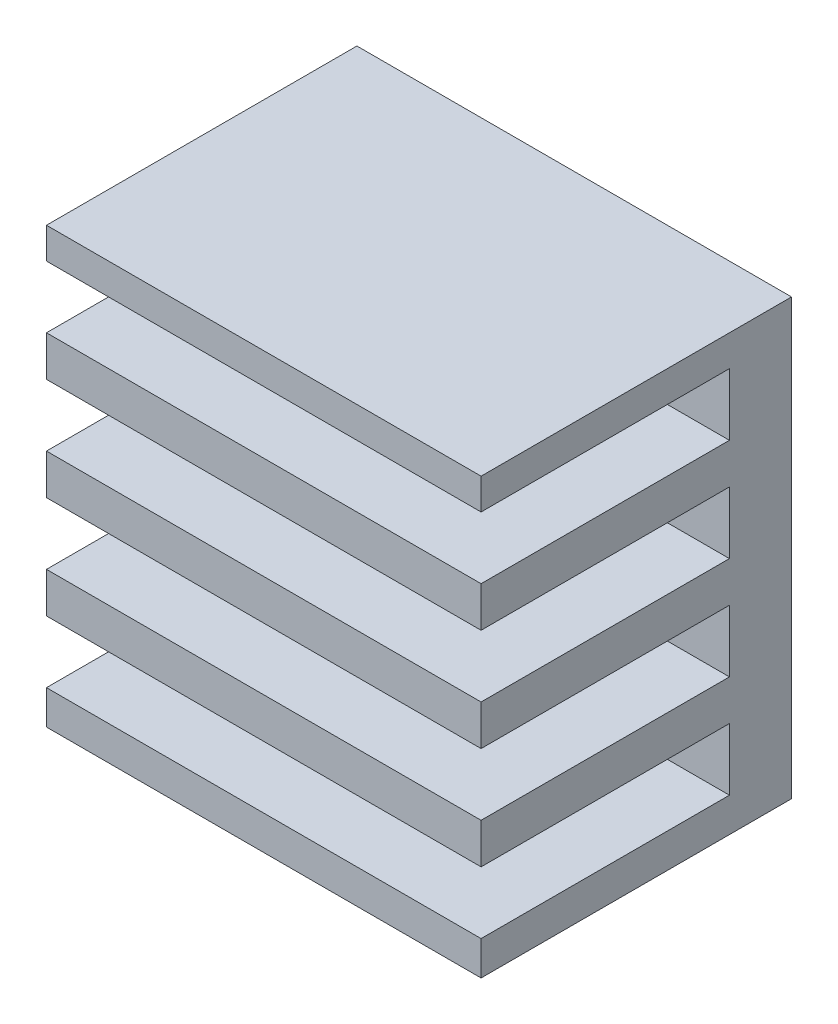
ISO-10303-21;
HEADER;
FILE_DESCRIPTION(('STEP AP214'),'2;1');
FILE_NAME('part.step','',(''),(''),'','','');
FILE_SCHEMA(('AUTOMOTIVE_DESIGN { 1 0 10303 214 1 1 1 1 }'));
ENDSEC;
DATA;
#1=APPLICATION_CONTEXT('core data for automotive mechanical design processes');
#2=APPLICATION_PROTOCOL_DEFINITION('international standard','automotive_design',2000,#1);
#3=PRODUCT_CONTEXT('',#1,'mechanical');
#4=PRODUCT('Part','Part','',(#3));
#5=PRODUCT_RELATED_PRODUCT_CATEGORY('part','',(#4));
#6=PRODUCT_DEFINITION_FORMATION('','',#4);
#7=PRODUCT_DEFINITION_CONTEXT('part definition',#1,'design');
#8=PRODUCT_DEFINITION('design','',#6,#7);
#9=PRODUCT_DEFINITION_SHAPE('','',#8);
#10=(LENGTH_UNIT() NAMED_UNIT(*) SI_UNIT(.MILLI.,.METRE.));
#11=(NAMED_UNIT(*) PLANE_ANGLE_UNIT() SI_UNIT($,.RADIAN.));
#12=(NAMED_UNIT(*) SI_UNIT($,.STERADIAN.) SOLID_ANGLE_UNIT());
#13=UNCERTAINTY_MEASURE_WITH_UNIT(LENGTH_MEASURE(1.E-05),#10,'distance_accuracy_value','');
#14=(GEOMETRIC_REPRESENTATION_CONTEXT(3) GLOBAL_UNCERTAINTY_ASSIGNED_CONTEXT((#13)) GLOBAL_UNIT_ASSIGNED_CONTEXT((#10,
#11,#12)) REPRESENTATION_CONTEXT('',''));
#15=CARTESIAN_POINT('',(0.,0.,0.));
#16=DIRECTION('',(0.,0.,1.));
#17=DIRECTION('',(1.,0.,0.));
#18=AXIS2_PLACEMENT_3D('',#15,#16,#17);
#19=CARTESIAN_POINT('',(0.,0.,10.));
#20=DIRECTION('',(0.,0.,1.));
#21=DIRECTION('',(1.,0.,0.));
#22=AXIS2_PLACEMENT_3D('',#19,#20,#21);
#23=PLANE('',#22);
#24=DIRECTION('',(-1.,0.,0.));
#25=VECTOR('',#24,1.);
#26=CARTESIAN_POINT('',(30.5,28.1999999999999,10.));
#27=LINE('',#26,#25);
#28=CARTESIAN_POINT('',(30.5,28.1999999999999,10.));
#29=VERTEX_POINT('',#28);
#30=CARTESIAN_POINT('',(16.5,28.1999999999999,10.));
#31=VERTEX_POINT('',#30);
#32=EDGE_CURVE('E281',#29,#31,#27,.T.);
#33=ORIENTED_EDGE('',*,*,#32,.T.);
#34=DIRECTION('',(0.,-1.,0.));
#35=VECTOR('',#34,1.);
#36=CARTESIAN_POINT('',(16.5,34.4999999999999,10.));
#37=LINE('',#36,#35);
#38=CARTESIAN_POINT('',(16.5,26.8999999999999,10.));
#39=VERTEX_POINT('',#38);
#40=EDGE_CURVE('E317',#31,#39,#37,.T.);
#41=ORIENTED_EDGE('',*,*,#40,.T.);
#42=DIRECTION('',(-1.,0.,0.));
#43=VECTOR('',#42,1.);
#44=CARTESIAN_POINT('',(30.5,26.8999999999999,10.));
#45=LINE('',#44,#43);
#46=CARTESIAN_POINT('',(30.5,26.8999999999999,10.));
#47=VERTEX_POINT('',#46);
#48=EDGE_CURVE('E227',#47,#39,#45,.T.);
#49=ORIENTED_EDGE('',*,*,#48,.F.);
#50=DIRECTION('',(0.,1.,0.));
#51=VECTOR('',#50,1.);
#52=CARTESIAN_POINT('',(30.5,34.4999999999999,10.));
#53=LINE('',#52,#51);
#54=EDGE_CURVE('E194',#47,#29,#53,.T.);
#55=ORIENTED_EDGE('',*,*,#54,.T.);
#56=EDGE_LOOP('',(#33,#41,#49,#55));
#57=FACE_BOUND('',#56,.T.);
#58=ADVANCED_FACE('F32',(#57),#23,.T.);
#59=DIRECTION('',(-1.,0.,0.));
#60=VECTOR('',#59,1.);
#61=CARTESIAN_POINT('',(30.5,24.8999999999999,10.));
#62=LINE('',#61,#60);
#63=CARTESIAN_POINT('',(30.5,24.8999999999999,10.));
#64=VERTEX_POINT('',#63);
#65=CARTESIAN_POINT('',(16.5,24.8999999999999,10.));
#66=VERTEX_POINT('',#65);
#67=EDGE_CURVE('E216',#64,#66,#62,.T.);
#68=ORIENTED_EDGE('',*,*,#67,.T.);
#69=CARTESIAN_POINT('',(16.5,23.5999999999999,10.));
#70=VERTEX_POINT('',#69);
#71=EDGE_CURVE('E315',#66,#70,#37,.T.);
#72=ORIENTED_EDGE('',*,*,#71,.T.);
#73=DIRECTION('',(-1.,0.,0.));
#74=VECTOR('',#73,1.);
#75=CARTESIAN_POINT('',(30.5,23.5999999999999,10.));
#76=LINE('',#75,#74);
#77=CARTESIAN_POINT('',(30.5,23.5999999999999,10.));
#78=VERTEX_POINT('',#77);
#79=EDGE_CURVE('E218',#78,#70,#76,.T.);
#80=ORIENTED_EDGE('',*,*,#79,.F.);
#81=EDGE_CURVE('E199',#78,#64,#53,.T.);
#82=ORIENTED_EDGE('',*,*,#81,.T.);
#83=EDGE_LOOP('',(#68,#72,#80,#82));
#84=FACE_BOUND('',#83,.T.);
#85=ADVANCED_FACE('F214',(#84),#23,.T.);
#86=DIRECTION('',(-1.,0.,0.));
#87=VECTOR('',#86,1.);
#88=CARTESIAN_POINT('',(30.5,21.5999999999999,10.));
#89=LINE('',#88,#87);
#90=CARTESIAN_POINT('',(30.5,21.5999999999999,10.));
#91=VERTEX_POINT('',#90);
#92=CARTESIAN_POINT('',(16.5,21.5999999999999,10.));
#93=VERTEX_POINT('',#92);
#94=EDGE_CURVE('E239',#91,#93,#89,.T.);
#95=ORIENTED_EDGE('',*,*,#94,.T.);
#96=CARTESIAN_POINT('',(16.5,20.4999999999999,10.));
#97=VERTEX_POINT('',#96);
#98=EDGE_CURVE('E295',#93,#97,#37,.T.);
#99=ORIENTED_EDGE('',*,*,#98,.T.);
#100=DIRECTION('',(1.,0.,0.));
#101=VECTOR('',#100,1.);
#102=CARTESIAN_POINT('',(16.5,20.4999999999999,10.));
#103=LINE('',#102,#101);
#104=CARTESIAN_POINT('',(30.5,20.4999999999999,10.));
#105=VERTEX_POINT('',#104);
#106=EDGE_CURVE('E200',#97,#105,#103,.T.);
#107=ORIENTED_EDGE('',*,*,#106,.T.);
#108=EDGE_CURVE('E197',#105,#91,#53,.T.);
#109=ORIENTED_EDGE('',*,*,#108,.T.);
#110=EDGE_LOOP('',(#95,#99,#107,#109));
#111=FACE_BOUND('',#110,.T.);
#112=ADVANCED_FACE('F298',(#111),#23,.T.);
#113=DIRECTION('',(-1.,0.,0.));
#114=VECTOR('',#113,1.);
#115=CARTESIAN_POINT('',(30.5,30.1999999999999,10.));
#116=LINE('',#115,#114);
#117=CARTESIAN_POINT('',(30.5,30.1999999999999,10.));
#118=VERTEX_POINT('',#117);
#119=CARTESIAN_POINT('',(16.5,30.1999999999999,10.));
#120=VERTEX_POINT('',#119);
#121=EDGE_CURVE('E172',#118,#120,#116,.T.);
#122=ORIENTED_EDGE('',*,*,#121,.F.);
#123=CARTESIAN_POINT('',(30.5,31.4999999999999,10.));
#124=VERTEX_POINT('',#123);
#125=EDGE_CURVE('E183',#118,#124,#53,.T.);
#126=ORIENTED_EDGE('',*,*,#125,.T.);
#127=DIRECTION('',(-1.,0.,0.));
#128=VECTOR('',#127,1.);
#129=CARTESIAN_POINT('',(30.5,31.4999999999999,10.));
#130=LINE('',#129,#128);
#131=CARTESIAN_POINT('',(16.5,31.4999999999999,10.));
#132=VERTEX_POINT('',#131);
#133=EDGE_CURVE('E285',#124,#132,#130,.T.);
#134=ORIENTED_EDGE('',*,*,#133,.T.);
#135=EDGE_CURVE('E186',#132,#120,#37,.T.);
#136=ORIENTED_EDGE('',*,*,#135,.T.);
#137=EDGE_LOOP('',(#122,#126,#134,#136));
#138=FACE_BOUND('',#137,.T.);
#139=ADVANCED_FACE('F181',(#138),#23,.T.);
#140=CARTESIAN_POINT('',(16.5,34.4999999999999,10.));
#141=DIRECTION('',(1.,0.,0.));
#142=DIRECTION('',(0.,0.,-1.));
#143=AXIS2_PLACEMENT_3D('',#140,#141,#142);
#144=PLANE('',#143);
#145=ORIENTED_EDGE('',*,*,#40,.F.);
#146=DIRECTION('',(0.,0.,1.));
#147=VECTOR('',#146,1.);
#148=CARTESIAN_POINT('',(16.5,28.1999999999999,10.));
#149=LINE('',#148,#147);
#150=CARTESIAN_POINT('',(16.5,28.1999999999999,2.));
#151=VERTEX_POINT('',#150);
#152=EDGE_CURVE('E177',#151,#31,#149,.T.);
#153=ORIENTED_EDGE('',*,*,#152,.F.);
#154=DIRECTION('',(0.,-1.,0.));
#155=VECTOR('',#154,1.);
#156=CARTESIAN_POINT('',(16.5,30.1999999999999,2.));
#157=LINE('',#156,#155);
#158=CARTESIAN_POINT('',(16.5,30.1999999999999,2.));
#159=VERTEX_POINT('',#158);
#160=EDGE_CURVE('E369',#159,#151,#157,.T.);
#161=ORIENTED_EDGE('',*,*,#160,.F.);
#162=DIRECTION('',(0.,0.,-1.));
#163=VECTOR('',#162,1.);
#164=CARTESIAN_POINT('',(16.5,30.1999999999999,10.));
#165=LINE('',#164,#163);
#166=EDGE_CURVE('E245',#120,#159,#165,.T.);
#167=ORIENTED_EDGE('',*,*,#166,.F.);
#168=ORIENTED_EDGE('',*,*,#135,.F.);
#169=DIRECTION('',(0.,0.,1.));
#170=VECTOR('',#169,1.);
#171=CARTESIAN_POINT('',(16.5,31.4999999999999,10.));
#172=LINE('',#171,#170);
#173=CARTESIAN_POINT('',(16.5,31.4999999999999,2.));
#174=VERTEX_POINT('',#173);
#175=EDGE_CURVE('E273',#174,#132,#172,.T.);
#176=ORIENTED_EDGE('',*,*,#175,.F.);
#177=DIRECTION('',(0.,-1.,0.));
#178=VECTOR('',#177,1.);
#179=CARTESIAN_POINT('',(16.5,33.4999999999999,2.));
#180=LINE('',#179,#178);
#181=CARTESIAN_POINT('',(16.5,33.4999999999999,2.));
#182=VERTEX_POINT('',#181);
#183=EDGE_CURVE('E280',#182,#174,#180,.T.);
#184=ORIENTED_EDGE('',*,*,#183,.F.);
#185=DIRECTION('',(0.,0.,-1.));
#186=VECTOR('',#185,1.);
#187=CARTESIAN_POINT('',(16.5,33.4999999999999,10.));
#188=LINE('',#187,#186);
#189=CARTESIAN_POINT('',(16.5,33.4999999999999,10.));
#190=VERTEX_POINT('',#189);
#191=EDGE_CURVE('E277',#190,#182,#188,.T.);
#192=ORIENTED_EDGE('',*,*,#191,.F.);
#193=CARTESIAN_POINT('',(16.5,34.4999999999999,10.));
#194=VERTEX_POINT('',#193);
#195=EDGE_CURVE('E293',#194,#190,#37,.T.);
#196=ORIENTED_EDGE('',*,*,#195,.F.);
#197=DIRECTION('',(0.,0.,-1.));
#198=VECTOR('',#197,1.);
#199=CARTESIAN_POINT('',(16.5,34.4999999999999,10.));
#200=LINE('',#199,#198);
#201=CARTESIAN_POINT('',(16.5,34.4999999999999,0.));
#202=VERTEX_POINT('',#201);
#203=EDGE_CURVE('E208',#194,#202,#200,.T.);
#204=ORIENTED_EDGE('',*,*,#203,.T.);
#205=DIRECTION('',(0.,-1.,0.));
#206=VECTOR('',#205,1.);
#207=CARTESIAN_POINT('',(16.5,34.4999999999999,0.));
#208=LINE('',#207,#206);
#209=CARTESIAN_POINT('',(16.5,20.4999999999999,0.));
#210=VERTEX_POINT('',#209);
#211=EDGE_CURVE('E287',#202,#210,#208,.T.);
#212=ORIENTED_EDGE('',*,*,#211,.T.);
#213=DIRECTION('',(0.,0.,-1.));
#214=VECTOR('',#213,1.);
#215=CARTESIAN_POINT('',(16.5,20.4999999999999,10.));
#216=LINE('',#215,#214);
#217=EDGE_CURVE('E11',#97,#210,#216,.T.);
#218=ORIENTED_EDGE('',*,*,#217,.F.);
#219=ORIENTED_EDGE('',*,*,#98,.F.);
#220=DIRECTION('',(0.,0.,1.));
#221=VECTOR('',#220,1.);
#222=CARTESIAN_POINT('',(16.5,21.5999999999999,10.));
#223=LINE('',#222,#221);
#224=CARTESIAN_POINT('',(16.5,21.5999999999999,2.));
#225=VERTEX_POINT('',#224);
#226=EDGE_CURVE('E251',#225,#93,#223,.T.);
#227=ORIENTED_EDGE('',*,*,#226,.F.);
#228=DIRECTION('',(0.,-1.,0.));
#229=VECTOR('',#228,1.);
#230=CARTESIAN_POINT('',(16.5,23.5999999999999,2.));
#231=LINE('',#230,#229);
#232=CARTESIAN_POINT('',(16.5,23.5999999999999,2.));
#233=VERTEX_POINT('',#232);
#234=EDGE_CURVE('E259',#233,#225,#231,.T.);
#235=ORIENTED_EDGE('',*,*,#234,.F.);
#236=DIRECTION('',(0.,0.,-1.));
#237=VECTOR('',#236,1.);
#238=CARTESIAN_POINT('',(16.5,23.5999999999999,10.));
#239=LINE('',#238,#237);
#240=EDGE_CURVE('E256',#70,#233,#239,.T.);
#241=ORIENTED_EDGE('',*,*,#240,.F.);
#242=ORIENTED_EDGE('',*,*,#71,.F.);
#243=DIRECTION('',(0.,0.,1.));
#244=VECTOR('',#243,1.);
#245=CARTESIAN_POINT('',(16.5,24.8999999999999,10.));
#246=LINE('',#245,#244);
#247=CARTESIAN_POINT('',(16.5,24.8999999999999,2.));
#248=VERTEX_POINT('',#247);
#249=EDGE_CURVE('E242',#248,#66,#246,.T.);
#250=ORIENTED_EDGE('',*,*,#249,.F.);
#251=DIRECTION('',(0.,-1.,0.));
#252=VECTOR('',#251,1.);
#253=CARTESIAN_POINT('',(16.5,26.8999999999999,2.));
#254=LINE('',#253,#252);
#255=CARTESIAN_POINT('',(16.5,26.8999999999999,2.));
#256=VERTEX_POINT('',#255);
#257=EDGE_CURVE('E238',#256,#248,#254,.T.);
#258=ORIENTED_EDGE('',*,*,#257,.F.);
#259=DIRECTION('',(0.,0.,-1.));
#260=VECTOR('',#259,1.);
#261=CARTESIAN_POINT('',(16.5,26.8999999999999,10.));
#262=LINE('',#261,#260);
#263=EDGE_CURVE('E235',#39,#256,#262,.T.);
#264=ORIENTED_EDGE('',*,*,#263,.F.);
#265=EDGE_LOOP('',(#145,#153,#161,#167,#168,#176,#184,#192,#196,#204,#212,#218,#219,#227,#235,
#241,#242,#250,#258,#264));
#266=FACE_BOUND('',#265,.T.);
#267=ADVANCED_FACE('F34',(#266),#144,.F.);
#268=CARTESIAN_POINT('',(16.5,20.4999999999999,10.));
#269=DIRECTION('',(0.,1.,0.));
#270=DIRECTION('',(-1.,0.,0.));
#271=AXIS2_PLACEMENT_3D('',#268,#269,#270);
#272=PLANE('',#271);
#273=DIRECTION('',(1.,0.,0.));
#274=VECTOR('',#273,1.);
#275=CARTESIAN_POINT('',(16.5,20.4999999999999,0.));
#276=LINE('',#275,#274);
#277=CARTESIAN_POINT('',(30.5,20.4999999999999,0.));
#278=VERTEX_POINT('',#277);
#279=EDGE_CURVE('E304',#210,#278,#276,.T.);
#280=ORIENTED_EDGE('',*,*,#279,.T.);
#281=DIRECTION('',(0.,0.,-1.));
#282=VECTOR('',#281,1.);
#283=CARTESIAN_POINT('',(30.5,20.4999999999999,10.));
#284=LINE('',#283,#282);
#285=EDGE_CURVE('E40',#105,#278,#284,.T.);
#286=ORIENTED_EDGE('',*,*,#285,.F.);
#287=ORIENTED_EDGE('',*,*,#106,.F.);
#288=ORIENTED_EDGE('',*,*,#217,.T.);
#289=EDGE_LOOP('',(#280,#286,#287,#288));
#290=FACE_BOUND('',#289,.T.);
#291=ADVANCED_FACE('F303',(#290),#272,.F.);
#292=CARTESIAN_POINT('',(30.5,34.4999999999999,10.));
#293=DIRECTION('',(-1.,0.,0.));
#294=DIRECTION('',(0.,-1.,0.));
#295=AXIS2_PLACEMENT_3D('',#292,#293,#294);
#296=PLANE('',#295);
#297=DIRECTION('',(0.,-1.,0.));
#298=VECTOR('',#297,1.);
#299=CARTESIAN_POINT('',(30.5,30.1999999999999,2.));
#300=LINE('',#299,#298);
#301=CARTESIAN_POINT('',(30.5,30.1999999999999,2.));
#302=VERTEX_POINT('',#301);
#303=CARTESIAN_POINT('',(30.5,28.1999999999999,2.));
#304=VERTEX_POINT('',#303);
#305=EDGE_CURVE('E47',#302,#304,#300,.T.);
#306=ORIENTED_EDGE('',*,*,#305,.T.);
#307=DIRECTION('',(0.,0.,1.));
#308=VECTOR('',#307,1.);
#309=CARTESIAN_POINT('',(30.5,28.1999999999999,10.));
#310=LINE('',#309,#308);
#311=EDGE_CURVE('E187',#304,#29,#310,.T.);
#312=ORIENTED_EDGE('',*,*,#311,.T.);
#313=ORIENTED_EDGE('',*,*,#54,.F.);
#314=DIRECTION('',(0.,0.,-1.));
#315=VECTOR('',#314,1.);
#316=CARTESIAN_POINT('',(30.5,26.8999999999999,10.));
#317=LINE('',#316,#315);
#318=CARTESIAN_POINT('',(30.5,26.8999999999999,2.));
#319=VERTEX_POINT('',#318);
#320=EDGE_CURVE('E231',#47,#319,#317,.T.);
#321=ORIENTED_EDGE('',*,*,#320,.T.);
#322=DIRECTION('',(0.,-1.,0.));
#323=VECTOR('',#322,1.);
#324=CARTESIAN_POINT('',(30.5,26.8999999999999,2.));
#325=LINE('',#324,#323);
#326=CARTESIAN_POINT('',(30.5,24.8999999999999,2.));
#327=VERTEX_POINT('',#326);
#328=EDGE_CURVE('E55',#319,#327,#325,.T.);
#329=ORIENTED_EDGE('',*,*,#328,.T.);
#330=DIRECTION('',(0.,0.,1.));
#331=VECTOR('',#330,1.);
#332=CARTESIAN_POINT('',(30.5,24.8999999999999,10.));
#333=LINE('',#332,#331);
#334=EDGE_CURVE('E224',#327,#64,#333,.T.);
#335=ORIENTED_EDGE('',*,*,#334,.T.);
#336=ORIENTED_EDGE('',*,*,#81,.F.);
#337=DIRECTION('',(0.,0.,-1.));
#338=VECTOR('',#337,1.);
#339=CARTESIAN_POINT('',(30.5,23.5999999999999,10.));
#340=LINE('',#339,#338);
#341=CARTESIAN_POINT('',(30.5,23.5999999999999,2.));
#342=VERTEX_POINT('',#341);
#343=EDGE_CURVE('E222',#78,#342,#340,.T.);
#344=ORIENTED_EDGE('',*,*,#343,.T.);
#345=DIRECTION('',(0.,-1.,0.));
#346=VECTOR('',#345,1.);
#347=CARTESIAN_POINT('',(30.5,23.5999999999999,2.));
#348=LINE('',#347,#346);
#349=CARTESIAN_POINT('',(30.5,21.5999999999999,2.));
#350=VERTEX_POINT('',#349);
#351=EDGE_CURVE('E250',#342,#350,#348,.T.);
#352=ORIENTED_EDGE('',*,*,#351,.T.);
#353=DIRECTION('',(0.,0.,1.));
#354=VECTOR('',#353,1.);
#355=CARTESIAN_POINT('',(30.5,21.5999999999999,10.));
#356=LINE('',#355,#354);
#357=EDGE_CURVE('E253',#350,#91,#356,.T.);
#358=ORIENTED_EDGE('',*,*,#357,.T.);
#359=ORIENTED_EDGE('',*,*,#108,.F.);
#360=ORIENTED_EDGE('',*,*,#285,.T.);
#361=DIRECTION('',(0.,1.,0.));
#362=VECTOR('',#361,1.);
#363=CARTESIAN_POINT('',(30.5,34.4999999999999,0.));
#364=LINE('',#363,#362);
#365=CARTESIAN_POINT('',(30.5,34.4999999999999,0.));
#366=VERTEX_POINT('',#365);
#367=EDGE_CURVE('E318',#278,#366,#364,.T.);
#368=ORIENTED_EDGE('',*,*,#367,.T.);
#369=DIRECTION('',(0.,0.,-1.));
#370=VECTOR('',#369,1.);
#371=CARTESIAN_POINT('',(30.5,34.4999999999999,10.));
#372=LINE('',#371,#370);
#373=CARTESIAN_POINT('',(30.5,34.4999999999999,10.));
#374=VERTEX_POINT('',#373);
#375=EDGE_CURVE('E306',#374,#366,#372,.T.);
#376=ORIENTED_EDGE('',*,*,#375,.F.);
#377=CARTESIAN_POINT('',(30.5,33.4999999999999,10.));
#378=VERTEX_POINT('',#377);
#379=EDGE_CURVE('E195',#378,#374,#53,.T.);
#380=ORIENTED_EDGE('',*,*,#379,.F.);
#381=DIRECTION('',(0.,0.,-1.));
#382=VECTOR('',#381,1.);
#383=CARTESIAN_POINT('',(30.5,33.4999999999999,10.));
#384=LINE('',#383,#382);
#385=CARTESIAN_POINT('',(30.5,33.4999999999999,2.));
#386=VERTEX_POINT('',#385);
#387=EDGE_CURVE('E269',#378,#386,#384,.T.);
#388=ORIENTED_EDGE('',*,*,#387,.T.);
#389=DIRECTION('',(0.,-1.,0.));
#390=VECTOR('',#389,1.);
#391=CARTESIAN_POINT('',(30.5,33.4999999999999,2.));
#392=LINE('',#391,#390);
#393=CARTESIAN_POINT('',(30.5,31.4999999999999,2.));
#394=VERTEX_POINT('',#393);
#395=EDGE_CURVE('E272',#386,#394,#392,.T.);
#396=ORIENTED_EDGE('',*,*,#395,.T.);
#397=DIRECTION('',(0.,0.,1.));
#398=VECTOR('',#397,1.);
#399=CARTESIAN_POINT('',(30.5,31.4999999999999,10.));
#400=LINE('',#399,#398);
#401=EDGE_CURVE('E193',#394,#124,#400,.T.);
#402=ORIENTED_EDGE('',*,*,#401,.T.);
#403=ORIENTED_EDGE('',*,*,#125,.F.);
#404=DIRECTION('',(0.,0.,-1.));
#405=VECTOR('',#404,1.);
#406=CARTESIAN_POINT('',(30.5,30.1999999999999,10.));
#407=LINE('',#406,#405);
#408=EDGE_CURVE('E168',#118,#302,#407,.T.);
#409=ORIENTED_EDGE('',*,*,#408,.T.);
#410=EDGE_LOOP('',(#306,#312,#313,#321,#329,#335,#336,#344,#352,#358,#359,#360,#368,#376,#380,
#388,#396,#402,#403,#409));
#411=FACE_BOUND('',#410,.T.);
#412=ADVANCED_FACE('F190',(#411),#296,.F.);
#413=CARTESIAN_POINT('',(16.5,34.4999999999999,10.));
#414=DIRECTION('',(0.,-1.,0.));
#415=DIRECTION('',(0.,0.,-1.));
#416=AXIS2_PLACEMENT_3D('',#413,#414,#415);
#417=PLANE('',#416);
#418=DIRECTION('',(-1.,0.,0.));
#419=VECTOR('',#418,1.);
#420=CARTESIAN_POINT('',(16.5,34.4999999999999,0.));
#421=LINE('',#420,#419);
#422=EDGE_CURVE('E316',#366,#202,#421,.T.);
#423=ORIENTED_EDGE('',*,*,#422,.T.);
#424=ORIENTED_EDGE('',*,*,#203,.F.);
#425=DIRECTION('',(-1.,0.,0.));
#426=VECTOR('',#425,1.);
#427=CARTESIAN_POINT('',(16.5,34.4999999999999,10.));
#428=LINE('',#427,#426);
#429=EDGE_CURVE('E204',#374,#194,#428,.T.);
#430=ORIENTED_EDGE('',*,*,#429,.F.);
#431=ORIENTED_EDGE('',*,*,#375,.T.);
#432=EDGE_LOOP('',(#423,#424,#430,#431));
#433=FACE_BOUND('',#432,.T.);
#434=ADVANCED_FACE('F331',(#433),#417,.F.);
#435=DIRECTION('',(-1.,0.,0.));
#436=VECTOR('',#435,1.);
#437=CARTESIAN_POINT('',(30.5,33.4999999999999,10.));
#438=LINE('',#437,#436);
#439=EDGE_CURVE('E276',#378,#190,#438,.T.);
#440=ORIENTED_EDGE('',*,*,#439,.F.);
#441=ORIENTED_EDGE('',*,*,#379,.T.);
#442=ORIENTED_EDGE('',*,*,#429,.T.);
#443=ORIENTED_EDGE('',*,*,#195,.T.);
#444=EDGE_LOOP('',(#440,#441,#442,#443));
#445=FACE_BOUND('',#444,.T.);
#446=ADVANCED_FACE('F342',(#445),#23,.T.);
#447=CARTESIAN_POINT('',(0.,0.,0.));
#448=DIRECTION('',(0.,0.,1.));
#449=DIRECTION('',(1.,0.,0.));
#450=AXIS2_PLACEMENT_3D('',#447,#448,#449);
#451=PLANE('',#450);
#452=ORIENTED_EDGE('',*,*,#211,.F.);
#453=ORIENTED_EDGE('',*,*,#422,.F.);
#454=ORIENTED_EDGE('',*,*,#367,.F.);
#455=ORIENTED_EDGE('',*,*,#279,.F.);
#456=EDGE_LOOP('',(#452,#453,#454,#455));
#457=FACE_BOUND('',#456,.T.);
#458=ADVANCED_FACE('F335',(#457),#451,.F.);
#459=CARTESIAN_POINT('',(30.5,31.4999999999999,10.));
#460=DIRECTION('',(0.,-1.,0.));
#461=DIRECTION('',(0.,0.,-1.));
#462=AXIS2_PLACEMENT_3D('',#459,#460,#461);
#463=PLANE('',#462);
#464=ORIENTED_EDGE('',*,*,#175,.T.);
#465=ORIENTED_EDGE('',*,*,#133,.F.);
#466=ORIENTED_EDGE('',*,*,#401,.F.);
#467=DIRECTION('',(-1.,0.,0.));
#468=VECTOR('',#467,1.);
#469=CARTESIAN_POINT('',(30.5,31.4999999999999,2.));
#470=LINE('',#469,#468);
#471=EDGE_CURVE('E288',#394,#174,#470,.T.);
#472=ORIENTED_EDGE('',*,*,#471,.T.);
#473=EDGE_LOOP('',(#464,#465,#466,#472));
#474=FACE_BOUND('',#473,.T.);
#475=ADVANCED_FACE('F350',(#474),#463,.F.);
#476=CARTESIAN_POINT('',(30.5,33.4999999999999,2.));
#477=DIRECTION('',(0.,0.,-1.));
#478=DIRECTION('',(0.,1.,0.));
#479=AXIS2_PLACEMENT_3D('',#476,#477,#478);
#480=PLANE('',#479);
#481=ORIENTED_EDGE('',*,*,#183,.T.);
#482=ORIENTED_EDGE('',*,*,#471,.F.);
#483=ORIENTED_EDGE('',*,*,#395,.F.);
#484=DIRECTION('',(-1.,0.,0.));
#485=VECTOR('',#484,1.);
#486=CARTESIAN_POINT('',(30.5,33.4999999999999,2.));
#487=LINE('',#486,#485);
#488=EDGE_CURVE('E290',#386,#182,#487,.T.);
#489=ORIENTED_EDGE('',*,*,#488,.T.);
#490=EDGE_LOOP('',(#481,#482,#483,#489));
#491=FACE_BOUND('',#490,.T.);
#492=ADVANCED_FACE('F347',(#491),#480,.F.);
#493=CARTESIAN_POINT('',(30.5,33.4999999999999,10.));
#494=DIRECTION('',(0.,1.,0.));
#495=DIRECTION('',(0.,0.,1.));
#496=AXIS2_PLACEMENT_3D('',#493,#494,#495);
#497=PLANE('',#496);
#498=ORIENTED_EDGE('',*,*,#191,.T.);
#499=ORIENTED_EDGE('',*,*,#488,.F.);
#500=ORIENTED_EDGE('',*,*,#387,.F.);
#501=ORIENTED_EDGE('',*,*,#439,.T.);
#502=EDGE_LOOP('',(#498,#499,#500,#501));
#503=FACE_BOUND('',#502,.T.);
#504=ADVANCED_FACE('F345',(#503),#497,.F.);
#505=CARTESIAN_POINT('',(30.5,21.5999999999999,10.));
#506=DIRECTION('',(0.,-1.,0.));
#507=DIRECTION('',(0.,0.,-1.));
#508=AXIS2_PLACEMENT_3D('',#505,#506,#507);
#509=PLANE('',#508);
#510=ORIENTED_EDGE('',*,*,#226,.T.);
#511=ORIENTED_EDGE('',*,*,#94,.F.);
#512=ORIENTED_EDGE('',*,*,#357,.F.);
#513=DIRECTION('',(-1.,0.,0.));
#514=VECTOR('',#513,1.);
#515=CARTESIAN_POINT('',(30.5,21.5999999999999,2.));
#516=LINE('',#515,#514);
#517=EDGE_CURVE('E264',#350,#225,#516,.T.);
#518=ORIENTED_EDGE('',*,*,#517,.T.);
#519=EDGE_LOOP('',(#510,#511,#512,#518));
#520=FACE_BOUND('',#519,.T.);
#521=ADVANCED_FACE('F309',(#520),#509,.F.);
#522=CARTESIAN_POINT('',(30.5,23.5999999999999,2.));
#523=DIRECTION('',(0.,0.,-1.));
#524=DIRECTION('',(0.,1.,0.));
#525=AXIS2_PLACEMENT_3D('',#522,#523,#524);
#526=PLANE('',#525);
#527=ORIENTED_EDGE('',*,*,#234,.T.);
#528=ORIENTED_EDGE('',*,*,#517,.F.);
#529=ORIENTED_EDGE('',*,*,#351,.F.);
#530=DIRECTION('',(-1.,0.,0.));
#531=VECTOR('',#530,1.);
#532=CARTESIAN_POINT('',(30.5,23.5999999999999,2.));
#533=LINE('',#532,#531);
#534=EDGE_CURVE('E266',#342,#233,#533,.T.);
#535=ORIENTED_EDGE('',*,*,#534,.T.);
#536=EDGE_LOOP('',(#527,#528,#529,#535));
#537=FACE_BOUND('',#536,.T.);
#538=ADVANCED_FACE('F483',(#537),#526,.F.);
#539=CARTESIAN_POINT('',(30.5,23.5999999999999,10.));
#540=DIRECTION('',(0.,1.,0.));
#541=DIRECTION('',(0.,0.,1.));
#542=AXIS2_PLACEMENT_3D('',#539,#540,#541);
#543=PLANE('',#542);
#544=ORIENTED_EDGE('',*,*,#240,.T.);
#545=ORIENTED_EDGE('',*,*,#534,.F.);
#546=ORIENTED_EDGE('',*,*,#343,.F.);
#547=ORIENTED_EDGE('',*,*,#79,.T.);
#548=EDGE_LOOP('',(#544,#545,#546,#547));
#549=FACE_BOUND('',#548,.T.);
#550=ADVANCED_FACE('F492',(#549),#543,.F.);
#551=CARTESIAN_POINT('',(30.5,24.8999999999999,10.));
#552=DIRECTION('',(0.,-1.,0.));
#553=DIRECTION('',(0.,0.,-1.));
#554=AXIS2_PLACEMENT_3D('',#551,#552,#553);
#555=PLANE('',#554);
#556=ORIENTED_EDGE('',*,*,#249,.T.);
#557=ORIENTED_EDGE('',*,*,#67,.F.);
#558=ORIENTED_EDGE('',*,*,#334,.F.);
#559=DIRECTION('',(-1.,0.,0.));
#560=VECTOR('',#559,1.);
#561=CARTESIAN_POINT('',(30.5,24.8999999999999,2.));
#562=LINE('',#561,#560);
#563=EDGE_CURVE('E246',#327,#248,#562,.T.);
#564=ORIENTED_EDGE('',*,*,#563,.T.);
#565=EDGE_LOOP('',(#556,#557,#558,#564));
#566=FACE_BOUND('',#565,.T.);
#567=ADVANCED_FACE('F502',(#566),#555,.F.);
#568=CARTESIAN_POINT('',(30.5,26.8999999999999,2.));
#569=DIRECTION('',(0.,0.,-1.));
#570=DIRECTION('',(0.,1.,0.));
#571=AXIS2_PLACEMENT_3D('',#568,#569,#570);
#572=PLANE('',#571);
#573=ORIENTED_EDGE('',*,*,#257,.T.);
#574=ORIENTED_EDGE('',*,*,#563,.F.);
#575=ORIENTED_EDGE('',*,*,#328,.F.);
#576=DIRECTION('',(-1.,0.,0.));
#577=VECTOR('',#576,1.);
#578=CARTESIAN_POINT('',(30.5,26.8999999999999,2.));
#579=LINE('',#578,#577);
#580=EDGE_CURVE('E229',#319,#256,#579,.T.);
#581=ORIENTED_EDGE('',*,*,#580,.T.);
#582=EDGE_LOOP('',(#573,#574,#575,#581));
#583=FACE_BOUND('',#582,.T.);
#584=ADVANCED_FACE('F512',(#583),#572,.F.);
#585=CARTESIAN_POINT('',(30.5,26.8999999999999,10.));
#586=DIRECTION('',(0.,1.,0.));
#587=DIRECTION('',(0.,0.,1.));
#588=AXIS2_PLACEMENT_3D('',#585,#586,#587);
#589=PLANE('',#588);
#590=ORIENTED_EDGE('',*,*,#263,.T.);
#591=ORIENTED_EDGE('',*,*,#580,.F.);
#592=ORIENTED_EDGE('',*,*,#320,.F.);
#593=ORIENTED_EDGE('',*,*,#48,.T.);
#594=EDGE_LOOP('',(#590,#591,#592,#593));
#595=FACE_BOUND('',#594,.T.);
#596=ADVANCED_FACE('F362',(#595),#589,.F.);
#597=CARTESIAN_POINT('',(30.5,28.1999999999999,10.));
#598=DIRECTION('',(0.,-1.,0.));
#599=DIRECTION('',(0.,0.,-1.));
#600=AXIS2_PLACEMENT_3D('',#597,#598,#599);
#601=PLANE('',#600);
#602=ORIENTED_EDGE('',*,*,#152,.T.);
#603=ORIENTED_EDGE('',*,*,#32,.F.);
#604=ORIENTED_EDGE('',*,*,#311,.F.);
#605=DIRECTION('',(-1.,0.,0.));
#606=VECTOR('',#605,1.);
#607=CARTESIAN_POINT('',(30.5,28.1999999999999,2.));
#608=LINE('',#607,#606);
#609=EDGE_CURVE('E365',#304,#151,#608,.T.);
#610=ORIENTED_EDGE('',*,*,#609,.T.);
#611=EDGE_LOOP('',(#602,#603,#604,#610));
#612=FACE_BOUND('',#611,.T.);
#613=ADVANCED_FACE('F377',(#612),#601,.F.);
#614=CARTESIAN_POINT('',(30.5,30.1999999999999,2.));
#615=DIRECTION('',(0.,0.,-1.));
#616=DIRECTION('',(0.,1.,0.));
#617=AXIS2_PLACEMENT_3D('',#614,#615,#616);
#618=PLANE('',#617);
#619=ORIENTED_EDGE('',*,*,#160,.T.);
#620=ORIENTED_EDGE('',*,*,#609,.F.);
#621=ORIENTED_EDGE('',*,*,#305,.F.);
#622=DIRECTION('',(-1.,0.,0.));
#623=VECTOR('',#622,1.);
#624=CARTESIAN_POINT('',(30.5,30.1999999999999,2.));
#625=LINE('',#624,#623);
#626=EDGE_CURVE('E174',#302,#159,#625,.T.);
#627=ORIENTED_EDGE('',*,*,#626,.T.);
#628=EDGE_LOOP('',(#619,#620,#621,#627));
#629=FACE_BOUND('',#628,.T.);
#630=ADVANCED_FACE('F378',(#629),#618,.F.);
#631=CARTESIAN_POINT('',(30.5,30.1999999999999,10.));
#632=DIRECTION('',(0.,1.,0.));
#633=DIRECTION('',(0.,0.,1.));
#634=AXIS2_PLACEMENT_3D('',#631,#632,#633);
#635=PLANE('',#634);
#636=ORIENTED_EDGE('',*,*,#166,.T.);
#637=ORIENTED_EDGE('',*,*,#626,.F.);
#638=ORIENTED_EDGE('',*,*,#408,.F.);
#639=ORIENTED_EDGE('',*,*,#121,.T.);
#640=EDGE_LOOP('',(#636,#637,#638,#639));
#641=FACE_BOUND('',#640,.T.);
#642=ADVANCED_FACE('F171',(#641),#635,.F.);
#643=CLOSED_SHELL('',(#58,#85,#112,#139,#267,#291,#412,#434,#446,#458,#475,#492,#504,#521,#538,
#550,#567,#584,#596,#613,#630,#642));
#644=MANIFOLD_SOLID_BREP('B2',#643);
#645=ADVANCED_BREP_SHAPE_REPRESENTATION('',(#18,#644),#14);
#646=SHAPE_DEFINITION_REPRESENTATION(#9,#645);
ENDSEC;
END-ISO-10303-21;
